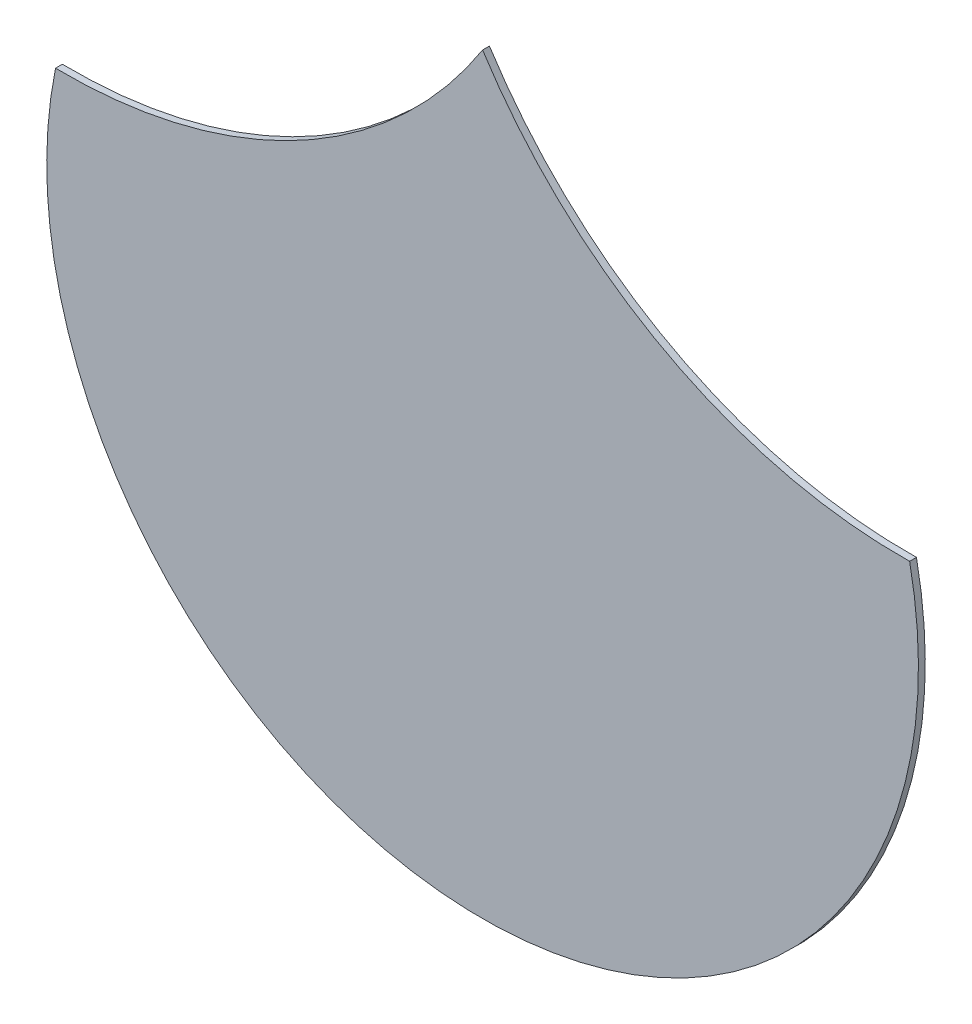
ISO-10303-21;
HEADER;
FILE_DESCRIPTION(('STEP AP214'),'2;1');
FILE_NAME('part.step','',(''),(''),'','','');
FILE_SCHEMA(('AUTOMOTIVE_DESIGN { 1 0 10303 214 1 1 1 1 }'));
ENDSEC;
DATA;
#1=APPLICATION_CONTEXT('core data for automotive mechanical design processes');
#2=APPLICATION_PROTOCOL_DEFINITION('international standard','automotive_design',2000,#1);
#3=PRODUCT_CONTEXT('',#1,'mechanical');
#4=PRODUCT('Part','Part','',(#3));
#5=PRODUCT_RELATED_PRODUCT_CATEGORY('part','',(#4));
#6=PRODUCT_DEFINITION_FORMATION('','',#4);
#7=PRODUCT_DEFINITION_CONTEXT('part definition',#1,'design');
#8=PRODUCT_DEFINITION('design','',#6,#7);
#9=PRODUCT_DEFINITION_SHAPE('','',#8);
#10=(LENGTH_UNIT() NAMED_UNIT(*) SI_UNIT(.MILLI.,.METRE.));
#11=(NAMED_UNIT(*) PLANE_ANGLE_UNIT() SI_UNIT($,.RADIAN.));
#12=(NAMED_UNIT(*) SI_UNIT($,.STERADIAN.) SOLID_ANGLE_UNIT());
#13=UNCERTAINTY_MEASURE_WITH_UNIT(LENGTH_MEASURE(1.E-05),#10,'distance_accuracy_value','');
#14=(GEOMETRIC_REPRESENTATION_CONTEXT(3) GLOBAL_UNCERTAINTY_ASSIGNED_CONTEXT((#13)) GLOBAL_UNIT_ASSIGNED_CONTEXT((#10,
#11,#12)) REPRESENTATION_CONTEXT('',''));
#15=CARTESIAN_POINT('',(0.,0.,0.));
#16=DIRECTION('',(0.,0.,1.));
#17=DIRECTION('',(1.,0.,0.));
#18=AXIS2_PLACEMENT_3D('',#15,#16,#17);
#19=CARTESIAN_POINT('',(25.1698102281086,23.9242225593515,0.1));
#20=DIRECTION('',(0.,0.,-1.));
#21=DIRECTION('',(-1.,0.,0.));
#22=AXIS2_PLACEMENT_3D('',#19,#20,#21);
#23=CYLINDRICAL_SURFACE('',#22,7.27563786724711);
#24=CARTESIAN_POINT('',(25.1698102281086,23.9242225593515,0.));
#25=DIRECTION('',(0.,0.,-1.));
#26=DIRECTION('',(1.,0.,0.));
#27=AXIS2_PLACEMENT_3D('',#24,#25,#26);
#28=CIRCLE('',#27,7.27563786724711);
#29=CARTESIAN_POINT('',(31.3000140638481,20.0056121796882,0.));
#30=VERTEX_POINT('',#29);
#31=CARTESIAN_POINT('',(25.0500140638481,16.6495710038233,0.));
#32=VERTEX_POINT('',#31);
#33=EDGE_CURVE('E80',#30,#32,#28,.T.);
#34=ORIENTED_EDGE('',*,*,#33,.T.);
#35=DIRECTION('',(0.,0.,-1.));
#36=VECTOR('',#35,1.);
#37=CARTESIAN_POINT('',(25.0500140638481,16.6495710038233,0.1));
#38=LINE('',#37,#36);
#39=CARTESIAN_POINT('',(25.0500140638481,16.6495710038233,0.1));
#40=VERTEX_POINT('',#39);
#41=EDGE_CURVE('E11',#40,#32,#38,.T.);
#42=ORIENTED_EDGE('',*,*,#41,.F.);
#43=CARTESIAN_POINT('',(25.1698102281086,23.9242225593515,0.1));
#44=DIRECTION('',(0.,0.,-1.));
#45=DIRECTION('',(1.,0.,0.));
#46=AXIS2_PLACEMENT_3D('',#43,#44,#45);
#47=CIRCLE('',#46,7.27563786724711);
#48=CARTESIAN_POINT('',(31.3000140638481,20.0056121796882,0.1));
#49=VERTEX_POINT('',#48);
#50=EDGE_CURVE('E73',#49,#40,#47,.T.);
#51=ORIENTED_EDGE('',*,*,#50,.F.);
#52=DIRECTION('',(0.,0.,-1.));
#53=VECTOR('',#52,1.);
#54=CARTESIAN_POINT('',(31.3000140638481,20.0056121796882,0.1));
#55=LINE('',#54,#53);
#56=EDGE_CURVE('E81',#49,#30,#55,.T.);
#57=ORIENTED_EDGE('',*,*,#56,.T.);
#58=EDGE_LOOP('',(#34,#42,#51,#57));
#59=FACE_BOUND('',#58,.T.);
#60=ADVANCED_FACE('F33',(#59),#23,.F.);
#61=CARTESIAN_POINT('',(31.300014063848,15.3734127207786,0.1));
#62=DIRECTION('',(0.,0.,-1.));
#63=DIRECTION('',(-1.,0.,0.));
#64=AXIS2_PLACEMENT_3D('',#61,#62,#63);
#65=CYLINDRICAL_SURFACE('',#64,6.37895602456886);
#66=CARTESIAN_POINT('',(31.300014063848,15.3734127207786,0.));
#67=DIRECTION('',(0.,0.,1.));
#68=DIRECTION('',(1.,0.,0.));
#69=AXIS2_PLACEMENT_3D('',#66,#67,#68);
#70=CIRCLE('',#69,6.37895602456886);
#71=CARTESIAN_POINT('',(37.550014063848,16.6495710038233,0.));
#72=VERTEX_POINT('',#71);
#73=EDGE_CURVE('E61',#32,#72,#70,.T.);
#74=ORIENTED_EDGE('',*,*,#73,.T.);
#75=DIRECTION('',(0.,0.,-1.));
#76=VECTOR('',#75,1.);
#77=CARTESIAN_POINT('',(37.550014063848,16.6495710038233,0.1));
#78=LINE('',#77,#76);
#79=CARTESIAN_POINT('',(37.550014063848,16.6495710038233,0.1));
#80=VERTEX_POINT('',#79);
#81=EDGE_CURVE('E41',#80,#72,#78,.T.);
#82=ORIENTED_EDGE('',*,*,#81,.F.);
#83=CARTESIAN_POINT('',(31.300014063848,15.3734127207786,0.1));
#84=DIRECTION('',(0.,0.,1.));
#85=DIRECTION('',(1.,0.,0.));
#86=AXIS2_PLACEMENT_3D('',#83,#84,#85);
#87=CIRCLE('',#86,6.37895602456886);
#88=EDGE_CURVE('E69',#40,#80,#87,.T.);
#89=ORIENTED_EDGE('',*,*,#88,.F.);
#90=ORIENTED_EDGE('',*,*,#41,.T.);
#91=EDGE_LOOP('',(#74,#82,#89,#90));
#92=FACE_BOUND('',#91,.T.);
#93=ADVANCED_FACE('F70',(#92),#65,.T.);
#94=CARTESIAN_POINT('',(37.4302178995875,23.9242225593515,0.1));
#95=DIRECTION('',(0.,0.,-1.));
#96=DIRECTION('',(-1.,0.,0.));
#97=AXIS2_PLACEMENT_3D('',#94,#95,#96);
#98=CYLINDRICAL_SURFACE('',#97,7.27563786724707);
#99=CARTESIAN_POINT('',(37.4302178995875,23.9242225593515,0.));
#100=DIRECTION('',(0.,0.,-1.));
#101=DIRECTION('',(1.,0.,0.));
#102=AXIS2_PLACEMENT_3D('',#99,#100,#101);
#103=CIRCLE('',#102,7.27563786724707);
#104=EDGE_CURVE('E66',#72,#30,#103,.T.);
#105=ORIENTED_EDGE('',*,*,#104,.T.);
#106=ORIENTED_EDGE('',*,*,#56,.F.);
#107=CARTESIAN_POINT('',(37.4302178995875,23.9242225593515,0.1));
#108=DIRECTION('',(0.,0.,-1.));
#109=DIRECTION('',(1.,0.,0.));
#110=AXIS2_PLACEMENT_3D('',#107,#108,#109);
#111=CIRCLE('',#110,7.27563786724707);
#112=EDGE_CURVE('E49',#80,#49,#111,.T.);
#113=ORIENTED_EDGE('',*,*,#112,.F.);
#114=ORIENTED_EDGE('',*,*,#81,.T.);
#115=EDGE_LOOP('',(#105,#106,#113,#114));
#116=FACE_BOUND('',#115,.T.);
#117=ADVANCED_FACE('F88',(#116),#98,.F.);
#118=CARTESIAN_POINT('',(31.3000140638481,23.9242225593515,0.1));
#119=DIRECTION('',(0.,0.,1.));
#120=DIRECTION('',(1.,0.,0.));
#121=AXIS2_PLACEMENT_3D('',#118,#119,#120);
#122=PLANE('',#121);
#123=ORIENTED_EDGE('',*,*,#50,.T.);
#124=ORIENTED_EDGE('',*,*,#88,.T.);
#125=ORIENTED_EDGE('',*,*,#112,.T.);
#126=EDGE_LOOP('',(#123,#124,#125));
#127=FACE_BOUND('',#126,.T.);
#128=ADVANCED_FACE('F76',(#127),#122,.T.);
#129=CARTESIAN_POINT('',(31.3000140638481,23.9242225593515,0.));
#130=DIRECTION('',(0.,0.,1.));
#131=DIRECTION('',(1.,0.,0.));
#132=AXIS2_PLACEMENT_3D('',#129,#130,#131);
#133=PLANE('',#132);
#134=ORIENTED_EDGE('',*,*,#33,.F.);
#135=ORIENTED_EDGE('',*,*,#104,.F.);
#136=ORIENTED_EDGE('',*,*,#73,.F.);
#137=EDGE_LOOP('',(#134,#135,#136));
#138=FACE_BOUND('',#137,.T.);
#139=ADVANCED_FACE('F89',(#138),#133,.F.);
#140=CLOSED_SHELL('',(#60,#93,#117,#128,#139));
#141=MANIFOLD_SOLID_BREP('B2',#140);
#142=ADVANCED_BREP_SHAPE_REPRESENTATION('',(#18,#141),#14);
#143=SHAPE_DEFINITION_REPRESENTATION(#9,#142);
ENDSEC;
END-ISO-10303-21;
